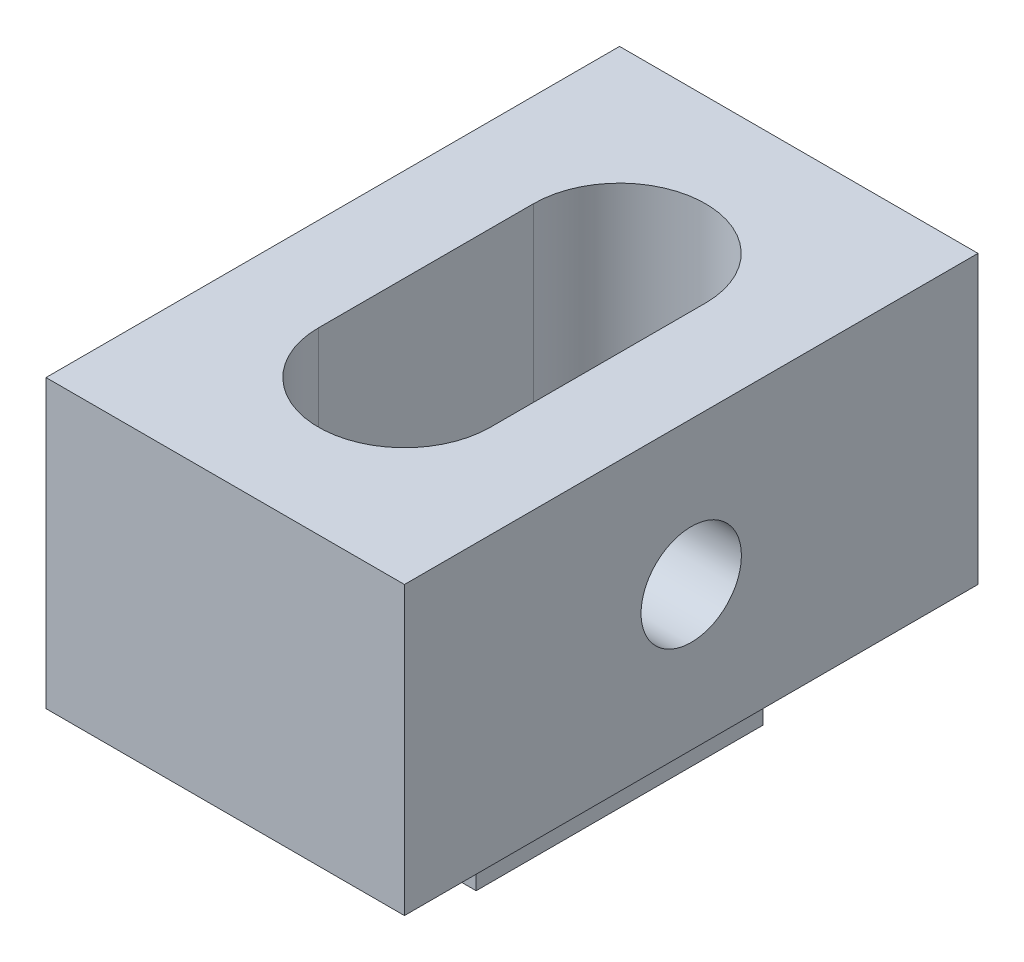
ISO-10303-21;
HEADER;
FILE_DESCRIPTION(('STEP AP214'),'2;1');
FILE_NAME('part.step','',(''),(''),'','','');
FILE_SCHEMA(('AUTOMOTIVE_DESIGN { 1 0 10303 214 1 1 1 1 }'));
ENDSEC;
DATA;
#1=APPLICATION_CONTEXT('core data for automotive mechanical design processes');
#2=APPLICATION_PROTOCOL_DEFINITION('international standard','automotive_design',2000,#1);
#3=PRODUCT_CONTEXT('',#1,'mechanical');
#4=PRODUCT('Part','Part','',(#3));
#5=PRODUCT_RELATED_PRODUCT_CATEGORY('part','',(#4));
#6=PRODUCT_DEFINITION_FORMATION('','',#4);
#7=PRODUCT_DEFINITION_CONTEXT('part definition',#1,'design');
#8=PRODUCT_DEFINITION('design','',#6,#7);
#9=PRODUCT_DEFINITION_SHAPE('','',#8);
#10=(LENGTH_UNIT() NAMED_UNIT(*) SI_UNIT(.MILLI.,.METRE.));
#11=(NAMED_UNIT(*) PLANE_ANGLE_UNIT() SI_UNIT($,.RADIAN.));
#12=(NAMED_UNIT(*) SI_UNIT($,.STERADIAN.) SOLID_ANGLE_UNIT());
#13=UNCERTAINTY_MEASURE_WITH_UNIT(LENGTH_MEASURE(1.E-05),#10,'distance_accuracy_value','');
#14=(GEOMETRIC_REPRESENTATION_CONTEXT(3) GLOBAL_UNCERTAINTY_ASSIGNED_CONTEXT((#13)) GLOBAL_UNIT_ASSIGNED_CONTEXT((#10,
#11,#12)) REPRESENTATION_CONTEXT('',''));
#15=CARTESIAN_POINT('',(0.,0.,0.));
#16=DIRECTION('',(0.,0.,1.));
#17=DIRECTION('',(1.,0.,0.));
#18=AXIS2_PLACEMENT_3D('',#15,#16,#17);
#19=CARTESIAN_POINT('',(25.,0.,20.));
#20=DIRECTION('',(-1.,0.,0.));
#21=DIRECTION('',(0.,0.,1.));
#22=AXIS2_PLACEMENT_3D('',#19,#20,#21);
#23=PLANE('',#22);
#24=DIRECTION('',(0.,1.,0.));
#25=VECTOR('',#24,1.);
#26=CARTESIAN_POINT('',(25.,0.,-20.));
#27=LINE('',#26,#25);
#28=CARTESIAN_POINT('',(25.,0.,-20.));
#29=VERTEX_POINT('',#28);
#30=CARTESIAN_POINT('',(25.,20.,-20.));
#31=VERTEX_POINT('',#30);
#32=EDGE_CURVE('E214',#29,#31,#27,.T.);
#33=ORIENTED_EDGE('',*,*,#32,.T.);
#34=DIRECTION('',(0.,0.,-1.));
#35=VECTOR('',#34,1.);
#36=CARTESIAN_POINT('',(25.,20.,20.));
#37=LINE('',#36,#35);
#38=CARTESIAN_POINT('',(25.,20.,20.));
#39=VERTEX_POINT('',#38);
#40=EDGE_CURVE('E219',#39,#31,#37,.T.);
#41=ORIENTED_EDGE('',*,*,#40,.F.);
#42=DIRECTION('',(0.,1.,0.));
#43=VECTOR('',#42,1.);
#44=CARTESIAN_POINT('',(25.,0.,20.));
#45=LINE('',#44,#43);
#46=CARTESIAN_POINT('',(25.,0.,20.));
#47=VERTEX_POINT('',#46);
#48=EDGE_CURVE('E205',#47,#39,#45,.T.);
#49=ORIENTED_EDGE('',*,*,#48,.F.);
#50=DIRECTION('',(0.,0.,-1.));
#51=VECTOR('',#50,1.);
#52=CARTESIAN_POINT('',(25.,0.,20.));
#53=LINE('',#52,#51);
#54=EDGE_CURVE('E45',#47,#29,#53,.T.);
#55=ORIENTED_EDGE('',*,*,#54,.T.);
#56=EDGE_LOOP('',(#33,#41,#49,#55));
#57=FACE_BOUND('',#56,.T.);
#58=CARTESIAN_POINT('',(25.,10.,0.));
#59=DIRECTION('',(1.,0.,0.));
#60=DIRECTION('',(0.,0.,-1.));
#61=AXIS2_PLACEMENT_3D('',#58,#59,#60);
#62=CIRCLE('',#61,3.50000000000002);
#63=CARTESIAN_POINT('',(25.,10.,-3.50000000000002));
#64=VERTEX_POINT('',#63);
#65=EDGE_CURVE('E158',#64,#64,#62,.T.);
#66=ORIENTED_EDGE('',*,*,#65,.F.);
#67=EDGE_LOOP('',(#66));
#68=FACE_BOUND('',#67,.T.);
#69=ADVANCED_FACE('F37',(#57,#68),#23,.F.);
#70=CARTESIAN_POINT('',(0.,0.,20.));
#71=DIRECTION('',(1.,0.,0.));
#72=DIRECTION('',(0.,0.,-1.));
#73=AXIS2_PLACEMENT_3D('',#70,#71,#72);
#74=PLANE('',#73);
#75=DIRECTION('',(0.,-1.,0.));
#76=VECTOR('',#75,1.);
#77=CARTESIAN_POINT('',(0.,0.,-20.));
#78=LINE('',#77,#76);
#79=CARTESIAN_POINT('',(0.,20.,-20.));
#80=VERTEX_POINT('',#79);
#81=CARTESIAN_POINT('',(0.,0.,-20.));
#82=VERTEX_POINT('',#81);
#83=EDGE_CURVE('E192',#80,#82,#78,.T.);
#84=ORIENTED_EDGE('',*,*,#83,.T.);
#85=DIRECTION('',(0.,0.,-1.));
#86=VECTOR('',#85,1.);
#87=CARTESIAN_POINT('',(0.,0.,20.));
#88=LINE('',#87,#86);
#89=CARTESIAN_POINT('',(0.,0.,20.));
#90=VERTEX_POINT('',#89);
#91=EDGE_CURVE('E11',#90,#82,#88,.T.);
#92=ORIENTED_EDGE('',*,*,#91,.F.);
#93=DIRECTION('',(0.,-1.,0.));
#94=VECTOR('',#93,1.);
#95=CARTESIAN_POINT('',(0.,0.,20.));
#96=LINE('',#95,#94);
#97=CARTESIAN_POINT('',(0.,20.,20.));
#98=VERTEX_POINT('',#97);
#99=EDGE_CURVE('E199',#98,#90,#96,.T.);
#100=ORIENTED_EDGE('',*,*,#99,.F.);
#101=DIRECTION('',(0.,0.,-1.));
#102=VECTOR('',#101,1.);
#103=CARTESIAN_POINT('',(0.,20.,20.));
#104=LINE('',#103,#102);
#105=EDGE_CURVE('E209',#98,#80,#104,.T.);
#106=ORIENTED_EDGE('',*,*,#105,.T.);
#107=EDGE_LOOP('',(#84,#92,#100,#106));
#108=FACE_BOUND('',#107,.T.);
#109=ADVANCED_FACE('F39',(#108),#74,.F.);
#110=CARTESIAN_POINT('',(0.,0.,20.));
#111=DIRECTION('',(0.,1.,0.));
#112=DIRECTION('',(0.,0.,1.));
#113=AXIS2_PLACEMENT_3D('',#110,#111,#112);
#114=PLANE('',#113);
#115=DIRECTION('',(-1.,0.,0.));
#116=VECTOR('',#115,1.);
#117=CARTESIAN_POINT('',(20.,0.,9.99999999999999));
#118=LINE('',#117,#116);
#119=CARTESIAN_POINT('',(20.,0.,9.99999999999999));
#120=VERTEX_POINT('',#119);
#121=CARTESIAN_POINT('',(5.,0.,10.));
#122=VERTEX_POINT('',#121);
#123=EDGE_CURVE('E145',#120,#122,#118,.T.);
#124=ORIENTED_EDGE('',*,*,#123,.F.);
#125=DIRECTION('',(0.,0.,-1.));
#126=VECTOR('',#125,1.);
#127=CARTESIAN_POINT('',(20.,0.,9.99999999999999));
#128=LINE('',#127,#126);
#129=CARTESIAN_POINT('',(20.,0.,-10.));
#130=VERTEX_POINT('',#129);
#131=EDGE_CURVE('E52',#120,#130,#128,.T.);
#132=ORIENTED_EDGE('',*,*,#131,.T.);
#133=DIRECTION('',(-1.,0.,0.));
#134=VECTOR('',#133,1.);
#135=CARTESIAN_POINT('',(20.,0.,-10.));
#136=LINE('',#135,#134);
#137=CARTESIAN_POINT('',(5.,0.,-10.));
#138=VERTEX_POINT('',#137);
#139=EDGE_CURVE('E57',#130,#138,#136,.T.);
#140=ORIENTED_EDGE('',*,*,#139,.T.);
#141=DIRECTION('',(0.,0.,-1.));
#142=VECTOR('',#141,1.);
#143=CARTESIAN_POINT('',(5.,0.,10.));
#144=LINE('',#143,#142);
#145=EDGE_CURVE('E148',#122,#138,#144,.T.);
#146=ORIENTED_EDGE('',*,*,#145,.F.);
#147=EDGE_LOOP('',(#124,#132,#140,#146));
#148=FACE_BOUND('',#147,.T.);
#149=DIRECTION('',(1.,0.,0.));
#150=VECTOR('',#149,1.);
#151=CARTESIAN_POINT('',(0.,0.,-20.));
#152=LINE('',#151,#150);
#153=EDGE_CURVE('E212',#82,#29,#152,.T.);
#154=ORIENTED_EDGE('',*,*,#153,.T.);
#155=ORIENTED_EDGE('',*,*,#54,.F.);
#156=DIRECTION('',(1.,0.,0.));
#157=VECTOR('',#156,1.);
#158=CARTESIAN_POINT('',(0.,0.,20.));
#159=LINE('',#158,#157);
#160=EDGE_CURVE('E202',#90,#47,#159,.T.);
#161=ORIENTED_EDGE('',*,*,#160,.F.);
#162=ORIENTED_EDGE('',*,*,#91,.T.);
#163=EDGE_LOOP('',(#154,#155,#161,#162));
#164=FACE_BOUND('',#163,.T.);
#165=ADVANCED_FACE('F242',(#148,#164),#114,.F.);
#166=CARTESIAN_POINT('',(0.,20.,20.));
#167=DIRECTION('',(0.,-1.,0.));
#168=DIRECTION('',(0.,0.,-1.));
#169=AXIS2_PLACEMENT_3D('',#166,#167,#168);
#170=PLANE('',#169);
#171=CARTESIAN_POINT('',(12.5,20.,7.5));
#172=DIRECTION('',(0.,1.,0.));
#173=DIRECTION('',(0.,0.,1.));
#174=AXIS2_PLACEMENT_3D('',#171,#172,#173);
#175=CIRCLE('',#174,6.);
#176=CARTESIAN_POINT('',(6.5,20.,7.5));
#177=VERTEX_POINT('',#176);
#178=CARTESIAN_POINT('',(18.5,20.,7.5));
#179=VERTEX_POINT('',#178);
#180=EDGE_CURVE('E182',#177,#179,#175,.T.);
#181=ORIENTED_EDGE('',*,*,#180,.F.);
#182=DIRECTION('',(0.,0.,1.));
#183=VECTOR('',#182,1.);
#184=CARTESIAN_POINT('',(6.5,20.,-7.5));
#185=LINE('',#184,#183);
#186=CARTESIAN_POINT('',(6.5,20.,-7.5));
#187=VERTEX_POINT('',#186);
#188=EDGE_CURVE('E168',#187,#177,#185,.T.);
#189=ORIENTED_EDGE('',*,*,#188,.F.);
#190=CARTESIAN_POINT('',(12.5,20.,-7.5));
#191=DIRECTION('',(0.,-1.,0.));
#192=DIRECTION('',(0.,0.,-1.));
#193=AXIS2_PLACEMENT_3D('',#190,#191,#192);
#194=CIRCLE('',#193,6.);
#195=CARTESIAN_POINT('',(18.5,20.,-7.50000000000001));
#196=VERTEX_POINT('',#195);
#197=EDGE_CURVE('E173',#187,#196,#194,.T.);
#198=ORIENTED_EDGE('',*,*,#197,.T.);
#199=DIRECTION('',(0.,0.,1.));
#200=VECTOR('',#199,1.);
#201=CARTESIAN_POINT('',(18.5,20.,-7.5));
#202=LINE('',#201,#200);
#203=EDGE_CURVE('E185',#196,#179,#202,.T.);
#204=ORIENTED_EDGE('',*,*,#203,.T.);
#205=EDGE_LOOP('',(#181,#189,#198,#204));
#206=FACE_BOUND('',#205,.T.);
#207=DIRECTION('',(-1.,0.,0.));
#208=VECTOR('',#207,1.);
#209=CARTESIAN_POINT('',(0.,20.,-20.));
#210=LINE('',#209,#208);
#211=EDGE_CURVE('E203',#31,#80,#210,.T.);
#212=ORIENTED_EDGE('',*,*,#211,.T.);
#213=ORIENTED_EDGE('',*,*,#105,.F.);
#214=DIRECTION('',(-1.,0.,0.));
#215=VECTOR('',#214,1.);
#216=CARTESIAN_POINT('',(0.,20.,20.));
#217=LINE('',#216,#215);
#218=EDGE_CURVE('E207',#39,#98,#217,.T.);
#219=ORIENTED_EDGE('',*,*,#218,.F.);
#220=ORIENTED_EDGE('',*,*,#40,.T.);
#221=EDGE_LOOP('',(#212,#213,#219,#220));
#222=FACE_BOUND('',#221,.T.);
#223=ADVANCED_FACE('F235',(#206,#222),#170,.F.);
#224=CARTESIAN_POINT('',(0.,0.,20.));
#225=DIRECTION('',(0.,0.,-1.));
#226=DIRECTION('',(-1.,0.,0.));
#227=AXIS2_PLACEMENT_3D('',#224,#225,#226);
#228=PLANE('',#227);
#229=ORIENTED_EDGE('',*,*,#99,.T.);
#230=ORIENTED_EDGE('',*,*,#160,.T.);
#231=ORIENTED_EDGE('',*,*,#48,.T.);
#232=ORIENTED_EDGE('',*,*,#218,.T.);
#233=EDGE_LOOP('',(#229,#230,#231,#232));
#234=FACE_BOUND('',#233,.T.);
#235=ADVANCED_FACE('F241',(#234),#228,.F.);
#236=CARTESIAN_POINT('',(0.,0.,-20.));
#237=DIRECTION('',(0.,0.,-1.));
#238=DIRECTION('',(-1.,0.,0.));
#239=AXIS2_PLACEMENT_3D('',#236,#237,#238);
#240=PLANE('',#239);
#241=ORIENTED_EDGE('',*,*,#83,.F.);
#242=ORIENTED_EDGE('',*,*,#211,.F.);
#243=ORIENTED_EDGE('',*,*,#32,.F.);
#244=ORIENTED_EDGE('',*,*,#153,.F.);
#245=EDGE_LOOP('',(#241,#242,#243,#244));
#246=FACE_BOUND('',#245,.T.);
#247=ADVANCED_FACE('F232',(#246),#240,.T.);
#248=CARTESIAN_POINT('',(6.5,2.,-7.5));
#249=DIRECTION('',(-1.,0.,0.));
#250=DIRECTION('',(0.,0.,1.));
#251=AXIS2_PLACEMENT_3D('',#248,#249,#250);
#252=PLANE('',#251);
#253=ORIENTED_EDGE('',*,*,#188,.T.);
#254=DIRECTION('',(0.,1.,0.));
#255=VECTOR('',#254,1.);
#256=CARTESIAN_POINT('',(6.5,2.,7.5));
#257=LINE('',#256,#255);
#258=CARTESIAN_POINT('',(6.5,2.,7.5));
#259=VERTEX_POINT('',#258);
#260=EDGE_CURVE('E180',#259,#177,#257,.T.);
#261=ORIENTED_EDGE('',*,*,#260,.F.);
#262=DIRECTION('',(0.,0.,1.));
#263=VECTOR('',#262,1.);
#264=CARTESIAN_POINT('',(6.5,2.,-7.5));
#265=LINE('',#264,#263);
#266=CARTESIAN_POINT('',(6.5,2.,-7.5));
#267=VERTEX_POINT('',#266);
#268=EDGE_CURVE('E169',#267,#259,#265,.T.);
#269=ORIENTED_EDGE('',*,*,#268,.F.);
#270=DIRECTION('',(0.,1.,0.));
#271=VECTOR('',#270,1.);
#272=CARTESIAN_POINT('',(6.5,2.,-7.5));
#273=LINE('',#272,#271);
#274=EDGE_CURVE('E190',#267,#187,#273,.T.);
#275=ORIENTED_EDGE('',*,*,#274,.T.);
#276=EDGE_LOOP('',(#253,#261,#269,#275));
#277=FACE_BOUND('',#276,.T.);
#278=ADVANCED_FACE('F261',(#277),#252,.F.);
#279=CARTESIAN_POINT('',(12.5,2.,-7.5));
#280=DIRECTION('',(0.,1.,0.));
#281=DIRECTION('',(0.,0.,1.));
#282=AXIS2_PLACEMENT_3D('',#279,#280,#281);
#283=CYLINDRICAL_SURFACE('',#282,6.);
#284=ORIENTED_EDGE('',*,*,#197,.F.);
#285=ORIENTED_EDGE('',*,*,#274,.F.);
#286=CARTESIAN_POINT('',(12.5,2.,-7.5));
#287=DIRECTION('',(0.,-1.,0.));
#288=DIRECTION('',(0.,0.,-1.));
#289=AXIS2_PLACEMENT_3D('',#286,#287,#288);
#290=CIRCLE('',#289,6.);
#291=CARTESIAN_POINT('',(18.5,2.,-7.50000000000001));
#292=VERTEX_POINT('',#291);
#293=EDGE_CURVE('E178',#267,#292,#290,.T.);
#294=ORIENTED_EDGE('',*,*,#293,.T.);
#295=DIRECTION('',(0.,1.,0.));
#296=VECTOR('',#295,1.);
#297=CARTESIAN_POINT('',(18.5,2.,-7.50000000000001));
#298=LINE('',#297,#296);
#299=EDGE_CURVE('E193',#292,#196,#298,.T.);
#300=ORIENTED_EDGE('',*,*,#299,.T.);
#301=EDGE_LOOP('',(#284,#285,#294,#300));
#302=FACE_BOUND('',#301,.T.);
#303=ADVANCED_FACE('F266',(#302),#283,.F.);
#304=CARTESIAN_POINT('',(18.5,2.,-7.5));
#305=DIRECTION('',(-1.,0.,0.));
#306=DIRECTION('',(0.,0.,1.));
#307=AXIS2_PLACEMENT_3D('',#304,#305,#306);
#308=PLANE('',#307);
#309=CARTESIAN_POINT('',(18.5,10.,0.));
#310=DIRECTION('',(-1.,0.,0.));
#311=DIRECTION('',(0.,0.,1.));
#312=AXIS2_PLACEMENT_3D('',#309,#310,#311);
#313=CIRCLE('',#312,3.50000000000001);
#314=CARTESIAN_POINT('',(18.5,10.,3.50000000000001));
#315=VERTEX_POINT('',#314);
#316=EDGE_CURVE('E165',#315,#315,#313,.T.);
#317=ORIENTED_EDGE('',*,*,#316,.F.);
#318=EDGE_LOOP('',(#317));
#319=FACE_BOUND('',#318,.T.);
#320=ORIENTED_EDGE('',*,*,#203,.F.);
#321=ORIENTED_EDGE('',*,*,#299,.F.);
#322=DIRECTION('',(0.,0.,1.));
#323=VECTOR('',#322,1.);
#324=CARTESIAN_POINT('',(18.5,2.,-7.5));
#325=LINE('',#324,#323);
#326=CARTESIAN_POINT('',(18.5,2.,7.5));
#327=VERTEX_POINT('',#326);
#328=EDGE_CURVE('E176',#292,#327,#325,.T.);
#329=ORIENTED_EDGE('',*,*,#328,.T.);
#330=DIRECTION('',(0.,1.,0.));
#331=VECTOR('',#330,1.);
#332=CARTESIAN_POINT('',(18.5,2.,7.5));
#333=LINE('',#332,#331);
#334=EDGE_CURVE('E195',#327,#179,#333,.T.);
#335=ORIENTED_EDGE('',*,*,#334,.T.);
#336=EDGE_LOOP('',(#320,#321,#329,#335));
#337=FACE_BOUND('',#336,.T.);
#338=ADVANCED_FACE('F272',(#319,#337),#308,.T.);
#339=CARTESIAN_POINT('',(12.5,2.,7.5));
#340=DIRECTION('',(0.,1.,0.));
#341=DIRECTION('',(0.,0.,1.));
#342=AXIS2_PLACEMENT_3D('',#339,#340,#341);
#343=CYLINDRICAL_SURFACE('',#342,6.);
#344=ORIENTED_EDGE('',*,*,#180,.T.);
#345=ORIENTED_EDGE('',*,*,#334,.F.);
#346=CARTESIAN_POINT('',(12.5,2.,7.5));
#347=DIRECTION('',(0.,1.,0.));
#348=DIRECTION('',(0.,0.,1.));
#349=AXIS2_PLACEMENT_3D('',#346,#347,#348);
#350=CIRCLE('',#349,6.);
#351=EDGE_CURVE('E172',#259,#327,#350,.T.);
#352=ORIENTED_EDGE('',*,*,#351,.F.);
#353=ORIENTED_EDGE('',*,*,#260,.T.);
#354=EDGE_LOOP('',(#344,#345,#352,#353));
#355=FACE_BOUND('',#354,.T.);
#356=ADVANCED_FACE('F268',(#355),#343,.F.);
#357=CARTESIAN_POINT('',(12.5,2.,7.5));
#358=DIRECTION('',(0.,1.,0.));
#359=DIRECTION('',(0.,0.,1.));
#360=AXIS2_PLACEMENT_3D('',#357,#358,#359);
#361=PLANE('',#360);
#362=ORIENTED_EDGE('',*,*,#268,.T.);
#363=ORIENTED_EDGE('',*,*,#351,.T.);
#364=ORIENTED_EDGE('',*,*,#328,.F.);
#365=ORIENTED_EDGE('',*,*,#293,.F.);
#366=EDGE_LOOP('',(#362,#363,#364,#365));
#367=FACE_BOUND('',#366,.T.);
#368=ADVANCED_FACE('F271',(#367),#361,.T.);
#369=CARTESIAN_POINT('',(25.,10.,0.));
#370=DIRECTION('',(1.,0.,0.));
#371=DIRECTION('',(0.,0.,-1.));
#372=AXIS2_PLACEMENT_3D('',#369,#370,#371);
#373=CYLINDRICAL_SURFACE('',#372,3.50000000000001);
#374=ORIENTED_EDGE('',*,*,#65,.T.);
#375=EDGE_LOOP('',(#374));
#376=FACE_BOUND('',#375,.T.);
#377=ORIENTED_EDGE('',*,*,#316,.T.);
#378=EDGE_LOOP('',(#377));
#379=FACE_BOUND('',#378,.T.);
#380=ADVANCED_FACE('F282',(#376,#379),#373,.F.);
#381=CARTESIAN_POINT('',(20.,-6.,9.99999999999999));
#382=DIRECTION('',(1.,0.,0.));
#383=DIRECTION('',(0.,0.,-1.));
#384=AXIS2_PLACEMENT_3D('',#381,#382,#383);
#385=PLANE('',#384);
#386=ORIENTED_EDGE('',*,*,#131,.F.);
#387=DIRECTION('',(0.,1.,0.));
#388=VECTOR('',#387,1.);
#389=CARTESIAN_POINT('',(20.,-6.,9.99999999999999));
#390=LINE('',#389,#388);
#391=CARTESIAN_POINT('',(20.,-6.,9.99999999999999));
#392=VERTEX_POINT('',#391);
#393=EDGE_CURVE('E143',#392,#120,#390,.T.);
#394=ORIENTED_EDGE('',*,*,#393,.F.);
#395=DIRECTION('',(0.,0.,-1.));
#396=VECTOR('',#395,1.);
#397=CARTESIAN_POINT('',(20.,-6.,9.99999999999999));
#398=LINE('',#397,#396);
#399=CARTESIAN_POINT('',(20.,-6.,-10.));
#400=VERTEX_POINT('',#399);
#401=EDGE_CURVE('E136',#392,#400,#398,.T.);
#402=ORIENTED_EDGE('',*,*,#401,.T.);
#403=DIRECTION('',(0.,1.,0.));
#404=VECTOR('',#403,1.);
#405=CARTESIAN_POINT('',(20.,-6.,-10.));
#406=LINE('',#405,#404);
#407=EDGE_CURVE('E124',#400,#130,#406,.T.);
#408=ORIENTED_EDGE('',*,*,#407,.T.);
#409=EDGE_LOOP('',(#386,#394,#402,#408));
#410=FACE_BOUND('',#409,.T.);
#411=ADVANCED_FACE('F141',(#410),#385,.T.);
#412=CARTESIAN_POINT('',(20.,-6.,9.99999999999999));
#413=DIRECTION('',(0.,0.,-1.));
#414=DIRECTION('',(-1.,0.,0.));
#415=AXIS2_PLACEMENT_3D('',#412,#413,#414);
#416=PLANE('',#415);
#417=ORIENTED_EDGE('',*,*,#123,.T.);
#418=DIRECTION('',(0.,1.,0.));
#419=VECTOR('',#418,1.);
#420=CARTESIAN_POINT('',(5.,-6.,10.));
#421=LINE('',#420,#419);
#422=CARTESIAN_POINT('',(5.,-6.,10.));
#423=VERTEX_POINT('',#422);
#424=EDGE_CURVE('E159',#423,#122,#421,.T.);
#425=ORIENTED_EDGE('',*,*,#424,.F.);
#426=DIRECTION('',(-1.,0.,0.));
#427=VECTOR('',#426,1.);
#428=CARTESIAN_POINT('',(20.,-6.,9.99999999999999));
#429=LINE('',#428,#427);
#430=EDGE_CURVE('E131',#392,#423,#429,.T.);
#431=ORIENTED_EDGE('',*,*,#430,.F.);
#432=ORIENTED_EDGE('',*,*,#393,.T.);
#433=EDGE_LOOP('',(#417,#425,#431,#432));
#434=FACE_BOUND('',#433,.T.);
#435=ADVANCED_FACE('F289',(#434),#416,.F.);
#436=CARTESIAN_POINT('',(5.,-6.,10.));
#437=DIRECTION('',(1.,0.,0.));
#438=DIRECTION('',(0.,0.,-1.));
#439=AXIS2_PLACEMENT_3D('',#436,#437,#438);
#440=PLANE('',#439);
#441=ORIENTED_EDGE('',*,*,#145,.T.);
#442=DIRECTION('',(0.,1.,0.));
#443=VECTOR('',#442,1.);
#444=CARTESIAN_POINT('',(5.,-6.,-10.));
#445=LINE('',#444,#443);
#446=CARTESIAN_POINT('',(5.,-6.,-10.));
#447=VERTEX_POINT('',#446);
#448=EDGE_CURVE('E130',#447,#138,#445,.T.);
#449=ORIENTED_EDGE('',*,*,#448,.F.);
#450=DIRECTION('',(0.,0.,-1.));
#451=VECTOR('',#450,1.);
#452=CARTESIAN_POINT('',(5.,-6.,10.));
#453=LINE('',#452,#451);
#454=EDGE_CURVE('E138',#423,#447,#453,.T.);
#455=ORIENTED_EDGE('',*,*,#454,.F.);
#456=ORIENTED_EDGE('',*,*,#424,.T.);
#457=EDGE_LOOP('',(#441,#449,#455,#456));
#458=FACE_BOUND('',#457,.T.);
#459=ADVANCED_FACE('F292',(#458),#440,.F.);
#460=CARTESIAN_POINT('',(20.,-6.,-10.));
#461=DIRECTION('',(0.,0.,-1.));
#462=DIRECTION('',(-1.,0.,0.));
#463=AXIS2_PLACEMENT_3D('',#460,#461,#462);
#464=PLANE('',#463);
#465=ORIENTED_EDGE('',*,*,#139,.F.);
#466=ORIENTED_EDGE('',*,*,#407,.F.);
#467=DIRECTION('',(-1.,0.,0.));
#468=VECTOR('',#467,1.);
#469=CARTESIAN_POINT('',(20.,-6.,-10.));
#470=LINE('',#469,#468);
#471=EDGE_CURVE('E127',#400,#447,#470,.T.);
#472=ORIENTED_EDGE('',*,*,#471,.T.);
#473=ORIENTED_EDGE('',*,*,#448,.T.);
#474=EDGE_LOOP('',(#465,#466,#472,#473));
#475=FACE_BOUND('',#474,.T.);
#476=ADVANCED_FACE('F126',(#475),#464,.T.);
#477=CARTESIAN_POINT('',(0.,-6.,0.));
#478=DIRECTION('',(0.,1.,0.));
#479=DIRECTION('',(0.,0.,1.));
#480=AXIS2_PLACEMENT_3D('',#477,#478,#479);
#481=PLANE('',#480);
#482=ORIENTED_EDGE('',*,*,#401,.F.);
#483=ORIENTED_EDGE('',*,*,#430,.T.);
#484=ORIENTED_EDGE('',*,*,#454,.T.);
#485=ORIENTED_EDGE('',*,*,#471,.F.);
#486=EDGE_LOOP('',(#482,#483,#484,#485));
#487=FACE_BOUND('',#486,.T.);
#488=ADVANCED_FACE('F135',(#487),#481,.F.);
#489=CLOSED_SHELL('',(#69,#109,#165,#223,#235,#247,#278,#303,#338,#356,#368,#380,#411,#435,#459,
#476,#488));
#490=MANIFOLD_SOLID_BREP('B2',#489);
#491=ADVANCED_BREP_SHAPE_REPRESENTATION('',(#18,#490),#14);
#492=SHAPE_DEFINITION_REPRESENTATION(#9,#491);
ENDSEC;
END-ISO-10303-21;
